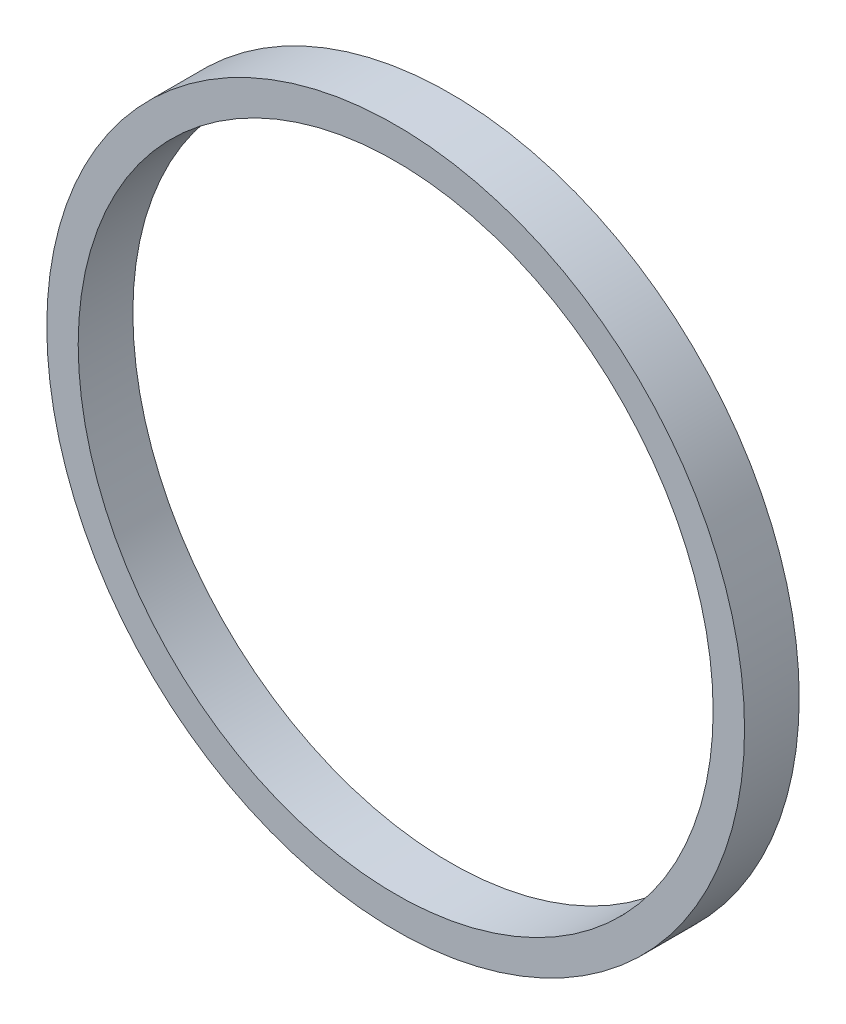
ISO-10303-21;
HEADER;
FILE_DESCRIPTION(('STEP AP214'),'2;1');
FILE_NAME('part.step','',(''),(''),'','','');
FILE_SCHEMA(('AUTOMOTIVE_DESIGN { 1 0 10303 214 1 1 1 1 }'));
ENDSEC;
DATA;
#1=APPLICATION_CONTEXT('core data for automotive mechanical design processes');
#2=APPLICATION_PROTOCOL_DEFINITION('international standard','automotive_design',2000,#1);
#3=PRODUCT_CONTEXT('',#1,'mechanical');
#4=PRODUCT('Part','Part','',(#3));
#5=PRODUCT_RELATED_PRODUCT_CATEGORY('part','',(#4));
#6=PRODUCT_DEFINITION_FORMATION('','',#4);
#7=PRODUCT_DEFINITION_CONTEXT('part definition',#1,'design');
#8=PRODUCT_DEFINITION('design','',#6,#7);
#9=PRODUCT_DEFINITION_SHAPE('','',#8);
#10=(LENGTH_UNIT() NAMED_UNIT(*) SI_UNIT(.MILLI.,.METRE.));
#11=(NAMED_UNIT(*) PLANE_ANGLE_UNIT() SI_UNIT($,.RADIAN.));
#12=(NAMED_UNIT(*) SI_UNIT($,.STERADIAN.) SOLID_ANGLE_UNIT());
#13=UNCERTAINTY_MEASURE_WITH_UNIT(LENGTH_MEASURE(1.E-05),#10,'distance_accuracy_value','');
#14=(GEOMETRIC_REPRESENTATION_CONTEXT(3) GLOBAL_UNCERTAINTY_ASSIGNED_CONTEXT((#13)) GLOBAL_UNIT_ASSIGNED_CONTEXT((#10,
#11,#12)) REPRESENTATION_CONTEXT('',''));
#15=CARTESIAN_POINT('',(0.,0.,0.));
#16=DIRECTION('',(0.,0.,1.));
#17=DIRECTION('',(1.,0.,0.));
#18=AXIS2_PLACEMENT_3D('',#15,#16,#17);
#19=CARTESIAN_POINT('',(40.,16.,9.68));
#20=DIRECTION('',(0.,0.,-1.));
#21=DIRECTION('',(-1.,0.,0.));
#22=AXIS2_PLACEMENT_3D('',#19,#20,#21);
#23=CYLINDRICAL_SURFACE('',#22,7.3756142);
#24=CARTESIAN_POINT('',(40.,16.,10.95));
#25=DIRECTION('',(0.,0.,-1.));
#26=DIRECTION('',(-1.,0.,0.));
#27=AXIS2_PLACEMENT_3D('',#24,#25,#26);
#28=CIRCLE('',#27,7.3756142);
#29=CARTESIAN_POINT('',(32.6243858,16.,10.95));
#30=VERTEX_POINT('',#29);
#31=EDGE_CURVE('E27',#30,#30,#28,.T.);
#32=ORIENTED_EDGE('',*,*,#31,.F.);
#33=EDGE_LOOP('',(#32));
#34=FACE_BOUND('',#33,.T.);
#35=CARTESIAN_POINT('',(40.,16.,9.68));
#36=DIRECTION('',(0.,0.,-1.));
#37=DIRECTION('',(-1.,0.,0.));
#38=AXIS2_PLACEMENT_3D('',#35,#36,#37);
#39=CIRCLE('',#38,7.3756142);
#40=CARTESIAN_POINT('',(32.6243858,16.,9.68));
#41=VERTEX_POINT('',#40);
#42=EDGE_CURVE('E18',#41,#41,#39,.T.);
#43=ORIENTED_EDGE('',*,*,#42,.T.);
#44=EDGE_LOOP('',(#43));
#45=FACE_BOUND('',#44,.T.);
#46=ADVANCED_FACE('F15',(#34,#45),#23,.F.);
#47=CARTESIAN_POINT('',(27.99999999999,16.000000000005,9.68));
#48=DIRECTION('',(0.,0.,1.));
#49=DIRECTION('',(1.,0.,0.));
#50=AXIS2_PLACEMENT_3D('',#47,#48,#49);
#51=PLANE('',#50);
#52=CARTESIAN_POINT('',(40.,16.,9.68));
#53=DIRECTION('',(0.,0.,-1.));
#54=DIRECTION('',(-1.,0.,0.));
#55=AXIS2_PLACEMENT_3D('',#52,#53,#54);
#56=CIRCLE('',#55,8.1051856);
#57=CARTESIAN_POINT('',(31.8948144,16.,9.68));
#58=VERTEX_POINT('',#57);
#59=EDGE_CURVE('E22',#58,#58,#56,.F.);
#60=ORIENTED_EDGE('',*,*,#59,.F.);
#61=EDGE_LOOP('',(#60));
#62=FACE_BOUND('',#61,.T.);
#63=ORIENTED_EDGE('',*,*,#42,.F.);
#64=EDGE_LOOP('',(#63));
#65=FACE_BOUND('',#64,.T.);
#66=ADVANCED_FACE('F36',(#62,#65),#51,.F.);
#67=CARTESIAN_POINT('',(27.99999999999,16.000000000005,10.95));
#68=DIRECTION('',(0.,0.,1.));
#69=DIRECTION('',(1.,0.,0.));
#70=AXIS2_PLACEMENT_3D('',#67,#68,#69);
#71=PLANE('',#70);
#72=CARTESIAN_POINT('',(40.,16.,10.95));
#73=DIRECTION('',(0.,0.,-1.));
#74=DIRECTION('',(-1.,0.,0.));
#75=AXIS2_PLACEMENT_3D('',#72,#73,#74);
#76=CIRCLE('',#75,8.1051856);
#77=CARTESIAN_POINT('',(31.8948144,16.,10.95));
#78=VERTEX_POINT('',#77);
#79=EDGE_CURVE('E10',#78,#78,#76,.T.);
#80=ORIENTED_EDGE('',*,*,#79,.F.);
#81=EDGE_LOOP('',(#80));
#82=FACE_BOUND('',#81,.T.);
#83=ORIENTED_EDGE('',*,*,#31,.T.);
#84=EDGE_LOOP('',(#83));
#85=FACE_BOUND('',#84,.T.);
#86=ADVANCED_FACE('F38',(#82,#85),#71,.T.);
#87=CARTESIAN_POINT('',(40.,16.,9.68));
#88=DIRECTION('',(0.,0.,-1.));
#89=DIRECTION('',(-1.,0.,0.));
#90=AXIS2_PLACEMENT_3D('',#87,#88,#89);
#91=CYLINDRICAL_SURFACE('',#90,8.1051856);
#92=ORIENTED_EDGE('',*,*,#79,.T.);
#93=EDGE_LOOP('',(#92));
#94=FACE_BOUND('',#93,.T.);
#95=ORIENTED_EDGE('',*,*,#59,.T.);
#96=EDGE_LOOP('',(#95));
#97=FACE_BOUND('',#96,.T.);
#98=ADVANCED_FACE('F45',(#94,#97),#91,.T.);
#99=CLOSED_SHELL('',(#46,#66,#86,#98));
#100=MANIFOLD_SOLID_BREP('B1',#99);
#101=ADVANCED_BREP_SHAPE_REPRESENTATION('',(#18,#100),#14);
#102=SHAPE_DEFINITION_REPRESENTATION(#9,#101);
ENDSEC;
END-ISO-10303-21;
